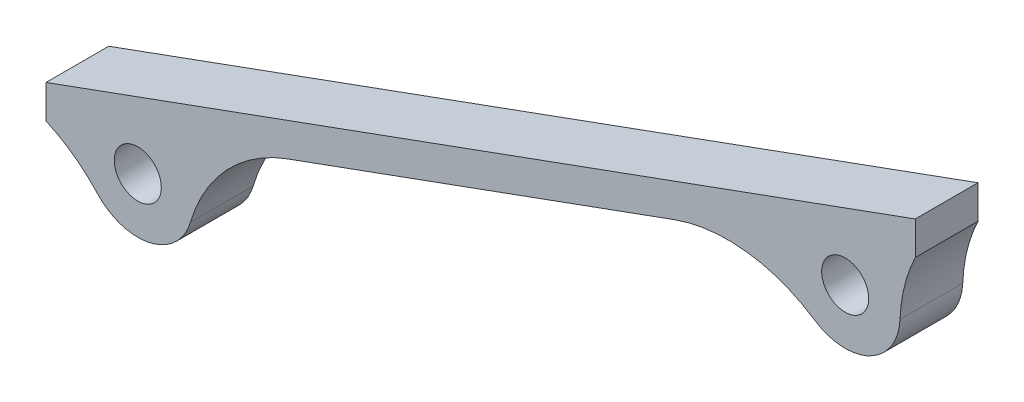
ISO-10303-21;
HEADER;
FILE_DESCRIPTION(('STEP AP214'),'2;1');
FILE_NAME('part.step','',(''),(''),'','','');
FILE_SCHEMA(('AUTOMOTIVE_DESIGN { 1 0 10303 214 1 1 1 1 }'));
ENDSEC;
DATA;
#1=APPLICATION_CONTEXT('core data for automotive mechanical design processes');
#2=APPLICATION_PROTOCOL_DEFINITION('international standard','automotive_design',2000,#1);
#3=PRODUCT_CONTEXT('',#1,'mechanical');
#4=PRODUCT('Part','Part','',(#3));
#5=PRODUCT_RELATED_PRODUCT_CATEGORY('part','',(#4));
#6=PRODUCT_DEFINITION_FORMATION('','',#4);
#7=PRODUCT_DEFINITION_CONTEXT('part definition',#1,'design');
#8=PRODUCT_DEFINITION('design','',#6,#7);
#9=PRODUCT_DEFINITION_SHAPE('','',#8);
#10=(LENGTH_UNIT() NAMED_UNIT(*) SI_UNIT(.MILLI.,.METRE.));
#11=(NAMED_UNIT(*) PLANE_ANGLE_UNIT() SI_UNIT($,.RADIAN.));
#12=(NAMED_UNIT(*) SI_UNIT($,.STERADIAN.) SOLID_ANGLE_UNIT());
#13=UNCERTAINTY_MEASURE_WITH_UNIT(LENGTH_MEASURE(1.E-05),#10,'distance_accuracy_value','');
#14=(GEOMETRIC_REPRESENTATION_CONTEXT(3) GLOBAL_UNCERTAINTY_ASSIGNED_CONTEXT((#13)) GLOBAL_UNIT_ASSIGNED_CONTEXT((#10,
#11,#12)) REPRESENTATION_CONTEXT('',''));
#15=CARTESIAN_POINT('',(0.,0.,0.));
#16=DIRECTION('',(0.,0.,1.));
#17=DIRECTION('',(1.,0.,0.));
#18=AXIS2_PLACEMENT_3D('',#15,#16,#17);
#19=CARTESIAN_POINT('',(-70.,-67.4869031986386,4.));
#20=DIRECTION('',(-0.342020143325671,0.939692620785908,0.));
#21=DIRECTION('',(-0.939692620785908,-0.342020143325671,0.));
#22=AXIS2_PLACEMENT_3D('',#19,#20,#21);
#23=PLANE('',#22);
#24=DIRECTION('',(0.939692620785908,0.342020143325671,0.));
#25=VECTOR('',#24,1.);
#26=CARTESIAN_POINT('',(-70.,-67.4869031986386,4.));
#27=LINE('',#26,#25);
#28=CARTESIAN_POINT('',(-54.6132084234672,-61.8865690639227,4.));
#29=VERTEX_POINT('',#28);
#30=CARTESIAN_POINT('',(-29.9449269501642,-52.9080488771399,4.));
#31=VERTEX_POINT('',#30);
#32=EDGE_CURVE('E125',#29,#31,#27,.T.);
#33=ORIENTED_EDGE('',*,*,#32,.F.);
#34=DIRECTION('',(0.,0.,-1.));
#35=VECTOR('',#34,1.);
#36=CARTESIAN_POINT('',(-54.6132084234672,-61.8865690639227,4.));
#37=LINE('',#36,#35);
#38=CARTESIAN_POINT('',(-54.6132084234672,-61.8865690639227,0.));
#39=VERTEX_POINT('',#38);
#40=EDGE_CURVE('E166',#29,#39,#37,.T.);
#41=ORIENTED_EDGE('',*,*,#40,.T.);
#42=DIRECTION('',(0.939692620785908,0.342020143325671,0.));
#43=VECTOR('',#42,1.);
#44=CARTESIAN_POINT('',(-70.,-67.4869031986386,0.));
#45=LINE('',#44,#43);
#46=CARTESIAN_POINT('',(-29.9449269501642,-52.9080488771399,0.));
#47=VERTEX_POINT('',#46);
#48=EDGE_CURVE('E158',#39,#47,#45,.T.);
#49=ORIENTED_EDGE('',*,*,#48,.T.);
#50=DIRECTION('',(0.,0.,-1.));
#51=VECTOR('',#50,1.);
#52=CARTESIAN_POINT('',(-29.9449269501642,-52.9080488771399,4.));
#53=LINE('',#52,#51);
#54=EDGE_CURVE('E163',#47,#31,#53,.F.);
#55=ORIENTED_EDGE('',*,*,#54,.T.);
#56=EDGE_LOOP('',(#33,#41,#49,#55));
#57=FACE_BOUND('',#56,.T.);
#58=ADVANCED_FACE('F37',(#57),#23,.F.);
#59=CARTESIAN_POINT('',(-70.,-65.3585476536867,4.));
#60=DIRECTION('',(1.,0.,0.));
#61=DIRECTION('',(0.,0.,-1.));
#62=AXIS2_PLACEMENT_3D('',#59,#60,#61);
#63=PLANE('',#62);
#64=DIRECTION('',(0.,-1.,0.));
#65=VECTOR('',#64,1.);
#66=CARTESIAN_POINT('',(-70.,-65.3585476536867,0.));
#67=LINE('',#66,#65);
#68=CARTESIAN_POINT('',(-70.,-65.3585476536867,0.));
#69=VERTEX_POINT('',#68);
#70=CARTESIAN_POINT('',(-70.,-67.4869031986386,0.));
#71=VERTEX_POINT('',#70);
#72=EDGE_CURVE('E133',#69,#71,#67,.T.);
#73=ORIENTED_EDGE('',*,*,#72,.T.);
#74=DIRECTION('',(0.,0.,-1.));
#75=VECTOR('',#74,1.);
#76=CARTESIAN_POINT('',(-70.,-67.4869031986386,4.));
#77=LINE('',#76,#75);
#78=CARTESIAN_POINT('',(-70.,-67.4869031986386,4.));
#79=VERTEX_POINT('',#78);
#80=EDGE_CURVE('E130',#79,#71,#77,.T.);
#81=ORIENTED_EDGE('',*,*,#80,.F.);
#82=DIRECTION('',(0.,-1.,0.));
#83=VECTOR('',#82,1.);
#84=CARTESIAN_POINT('',(-70.,-65.3585476536867,4.));
#85=LINE('',#84,#83);
#86=CARTESIAN_POINT('',(-70.,-65.3585476536867,4.));
#87=VERTEX_POINT('',#86);
#88=EDGE_CURVE('E114',#87,#79,#85,.T.);
#89=ORIENTED_EDGE('',*,*,#88,.F.);
#90=DIRECTION('',(0.,0.,-1.));
#91=VECTOR('',#90,1.);
#92=CARTESIAN_POINT('',(-70.,-65.3585476536867,4.));
#93=LINE('',#92,#91);
#94=EDGE_CURVE('E195',#87,#69,#93,.T.);
#95=ORIENTED_EDGE('',*,*,#94,.T.);
#96=EDGE_LOOP('',(#73,#81,#89,#95));
#97=FACE_BOUND('',#96,.T.);
#98=ADVANCED_FACE('F131',(#97),#63,.F.);
#99=CARTESIAN_POINT('',(-14.5723358707317,-47.3128833006803,4.));
#100=DIRECTION('',(-1.,0.,0.));
#101=DIRECTION('',(0.,0.,1.));
#102=AXIS2_PLACEMENT_3D('',#99,#100,#101);
#103=PLANE('',#102);
#104=DIRECTION('',(0.,1.,0.));
#105=VECTOR('',#104,1.);
#106=CARTESIAN_POINT('',(-14.5723358707317,-47.3128833006803,0.));
#107=LINE('',#106,#105);
#108=CARTESIAN_POINT('',(-14.5723358707317,-47.3128833006803,0.));
#109=VERTEX_POINT('',#108);
#110=CARTESIAN_POINT('',(-14.5723358707317,-45.1845277557284,0.));
#111=VERTEX_POINT('',#110);
#112=EDGE_CURVE('E167',#109,#111,#107,.T.);
#113=ORIENTED_EDGE('',*,*,#112,.T.);
#114=DIRECTION('',(0.,0.,-1.));
#115=VECTOR('',#114,1.);
#116=CARTESIAN_POINT('',(-14.5723358707317,-45.1845277557284,4.));
#117=LINE('',#116,#115);
#118=CARTESIAN_POINT('',(-14.5723358707317,-45.1845277557284,4.));
#119=VERTEX_POINT('',#118);
#120=EDGE_CURVE('E193',#119,#111,#117,.T.);
#121=ORIENTED_EDGE('',*,*,#120,.F.);
#122=DIRECTION('',(0.,1.,0.));
#123=VECTOR('',#122,1.);
#124=CARTESIAN_POINT('',(-14.5723358707317,-47.3128833006803,4.));
#125=LINE('',#124,#123);
#126=CARTESIAN_POINT('',(-14.5723358707317,-47.3128833006803,4.));
#127=VERTEX_POINT('',#126);
#128=EDGE_CURVE('E223',#127,#119,#125,.T.);
#129=ORIENTED_EDGE('',*,*,#128,.F.);
#130=DIRECTION('',(0.,0.,-1.));
#131=VECTOR('',#130,1.);
#132=CARTESIAN_POINT('',(-14.5723358707317,-47.3128833006803,4.));
#133=LINE('',#132,#131);
#134=EDGE_CURVE('E136',#127,#109,#133,.T.);
#135=ORIENTED_EDGE('',*,*,#134,.T.);
#136=EDGE_LOOP('',(#113,#121,#129,#135));
#137=FACE_BOUND('',#136,.T.);
#138=ADVANCED_FACE('F233',(#137),#103,.F.);
#139=CARTESIAN_POINT('',(-70.,-65.3585476536867,4.));
#140=DIRECTION('',(-0.342020143325671,0.939692620785908,0.));
#141=DIRECTION('',(-0.939692620785908,-0.342020143325671,0.));
#142=AXIS2_PLACEMENT_3D('',#139,#140,#141);
#143=PLANE('',#142);
#144=DIRECTION('',(0.939692620785908,0.342020143325671,0.));
#145=VECTOR('',#144,1.);
#146=CARTESIAN_POINT('',(-70.,-65.3585476536867,0.));
#147=LINE('',#146,#145);
#148=EDGE_CURVE('E126',#69,#111,#147,.T.);
#149=ORIENTED_EDGE('',*,*,#148,.F.);
#150=ORIENTED_EDGE('',*,*,#94,.F.);
#151=DIRECTION('',(0.939692620785908,0.342020143325671,0.));
#152=VECTOR('',#151,1.);
#153=CARTESIAN_POINT('',(-70.,-65.3585476536867,4.));
#154=LINE('',#153,#152);
#155=EDGE_CURVE('E123',#87,#119,#154,.T.);
#156=ORIENTED_EDGE('',*,*,#155,.T.);
#157=ORIENTED_EDGE('',*,*,#120,.T.);
#158=EDGE_LOOP('',(#149,#150,#156,#157));
#159=FACE_BOUND('',#158,.T.);
#160=ADVANCED_FACE('F231',(#159),#143,.T.);
#161=CARTESIAN_POINT('',(0.,0.,4.));
#162=DIRECTION('',(0.,0.,1.));
#163=DIRECTION('',(1.,0.,0.));
#164=AXIS2_PLACEMENT_3D('',#161,#162,#163);
#165=PLANE('',#164);
#166=ORIENTED_EDGE('',*,*,#88,.T.);
#167=CARTESIAN_POINT('',(-74.098227445234,-76.6085550121606,4.));
#168=DIRECTION('',(0.,0.,1.));
#169=DIRECTION('',(1.,0.,0.));
#170=AXIS2_PLACEMENT_3D('',#167,#168,#169);
#171=CIRCLE('',#170,10.);
#172=CARTESIAN_POINT('',(-66.7274295591541,-69.8504977082781,4.));
#173=VERTEX_POINT('',#172);
#174=EDGE_CURVE('E120',#79,#173,#171,.F.);
#175=ORIENTED_EDGE('',*,*,#174,.T.);
#176=CARTESIAN_POINT('',(-64.1476502990262,-67.4851776519192,4.));
#177=DIRECTION('',(0.,0.,1.));
#178=DIRECTION('',(1.,0.,0.));
#179=AXIS2_PLACEMENT_3D('',#176,#177,#178);
#180=CIRCLE('',#179,3.50000000000001);
#181=CARTESIAN_POINT('',(-60.7890390708147,-68.4699266644761,4.));
#182=VERTEX_POINT('',#181);
#183=EDGE_CURVE('E202',#182,#173,#180,.F.);
#184=ORIENTED_EDGE('',*,*,#183,.F.);
#185=CARTESIAN_POINT('',(-51.1930069902105,-71.2834952717817,4.));
#186=DIRECTION('',(0.,0.,1.));
#187=DIRECTION('',(1.,0.,0.));
#188=AXIS2_PLACEMENT_3D('',#185,#186,#187);
#189=CIRCLE('',#188,10.);
#190=EDGE_CURVE('E145',#182,#29,#189,.F.);
#191=ORIENTED_EDGE('',*,*,#190,.T.);
#192=ORIENTED_EDGE('',*,*,#32,.T.);
#193=CARTESIAN_POINT('',(-26.5247255169075,-62.304975084999,4.));
#194=DIRECTION('',(0.,0.,1.));
#195=DIRECTION('',(1.,0.,0.));
#196=AXIS2_PLACEMENT_3D('',#193,#194,#195);
#197=CIRCLE('',#196,10.);
#198=CARTESIAN_POINT('',(-20.9822655053483,-53.9814459644716,4.));
#199=VERTEX_POINT('',#198);
#200=EDGE_CURVE('E12',#31,#199,#197,.F.);
#201=ORIENTED_EDGE('',*,*,#200,.T.);
#202=CARTESIAN_POINT('',(-19.0424045013026,-51.068210772287,4.));
#203=DIRECTION('',(0.,0.,1.));
#204=DIRECTION('',(1.,0.,0.));
#205=AXIS2_PLACEMENT_3D('',#202,#203,#204);
#206=CIRCLE('',#205,3.50000000000001);
#207=CARTESIAN_POINT('',(-15.545482944416,-51.2149746131396,4.));
#208=VERTEX_POINT('',#207);
#209=EDGE_CURVE('E181',#208,#199,#206,.F.);
#210=ORIENTED_EDGE('',*,*,#209,.F.);
#211=CARTESIAN_POINT('',(-5.55427849616855,-51.6342998727186,4.));
#212=DIRECTION('',(0.,0.,1.));
#213=DIRECTION('',(1.,0.,0.));
#214=AXIS2_PLACEMENT_3D('',#211,#212,#213);
#215=CIRCLE('',#214,10.);
#216=EDGE_CURVE('E153',#208,#127,#215,.F.);
#217=ORIENTED_EDGE('',*,*,#216,.T.);
#218=ORIENTED_EDGE('',*,*,#128,.T.);
#219=ORIENTED_EDGE('',*,*,#155,.F.);
#220=EDGE_LOOP('',(#166,#175,#184,#191,#192,#201,#210,#217,#218,#219));
#221=FACE_BOUND('',#220,.T.);
#222=CARTESIAN_POINT('',(-19.0424045013026,-51.068210772287,4.));
#223=DIRECTION('',(0.,0.,1.));
#224=DIRECTION('',(1.,0.,0.));
#225=AXIS2_PLACEMENT_3D('',#222,#223,#224);
#226=CIRCLE('',#225,1.5);
#227=CARTESIAN_POINT('',(-17.5424045013026,-51.068210772287,4.));
#228=VERTEX_POINT('',#227);
#229=EDGE_CURVE('E216',#228,#228,#226,.F.);
#230=ORIENTED_EDGE('',*,*,#229,.T.);
#231=EDGE_LOOP('',(#230));
#232=FACE_BOUND('',#231,.T.);
#233=CARTESIAN_POINT('',(-64.1476502990262,-67.4851776519192,4.));
#234=DIRECTION('',(0.,0.,1.));
#235=DIRECTION('',(1.,0.,0.));
#236=AXIS2_PLACEMENT_3D('',#233,#234,#235);
#237=CIRCLE('',#236,1.5);
#238=CARTESIAN_POINT('',(-62.6476502990262,-67.4851776519192,4.));
#239=VERTEX_POINT('',#238);
#240=EDGE_CURVE('E186',#239,#239,#237,.F.);
#241=ORIENTED_EDGE('',*,*,#240,.T.);
#242=EDGE_LOOP('',(#241));
#243=FACE_BOUND('',#242,.T.);
#244=ADVANCED_FACE('F116',(#221,#232,#243),#165,.T.);
#245=CARTESIAN_POINT('',(0.,0.,0.));
#246=DIRECTION('',(0.,0.,1.));
#247=DIRECTION('',(1.,0.,0.));
#248=AXIS2_PLACEMENT_3D('',#245,#246,#247);
#249=PLANE('',#248);
#250=ORIENTED_EDGE('',*,*,#72,.F.);
#251=ORIENTED_EDGE('',*,*,#148,.T.);
#252=ORIENTED_EDGE('',*,*,#112,.F.);
#253=CARTESIAN_POINT('',(-5.55427849616855,-51.6342998727186,0.));
#254=DIRECTION('',(0.,0.,1.));
#255=DIRECTION('',(1.,0.,0.));
#256=AXIS2_PLACEMENT_3D('',#253,#254,#255);
#257=CIRCLE('',#256,10.);
#258=CARTESIAN_POINT('',(-15.545482944416,-51.2149746131396,0.));
#259=VERTEX_POINT('',#258);
#260=EDGE_CURVE('E59',#109,#259,#257,.T.);
#261=ORIENTED_EDGE('',*,*,#260,.T.);
#262=CARTESIAN_POINT('',(-19.0424045013026,-51.068210772287,0.));
#263=DIRECTION('',(0.,0.,-1.));
#264=DIRECTION('',(-1.,0.,0.));
#265=AXIS2_PLACEMENT_3D('',#262,#263,#264);
#266=CIRCLE('',#265,3.50000000000001);
#267=CARTESIAN_POINT('',(-20.9822655053483,-53.9814459644716,0.));
#268=VERTEX_POINT('',#267);
#269=EDGE_CURVE('E159',#259,#268,#266,.T.);
#270=ORIENTED_EDGE('',*,*,#269,.T.);
#271=CARTESIAN_POINT('',(-26.5247255169075,-62.304975084999,0.));
#272=DIRECTION('',(0.,0.,1.));
#273=DIRECTION('',(1.,0.,0.));
#274=AXIS2_PLACEMENT_3D('',#271,#272,#273);
#275=CIRCLE('',#274,10.);
#276=EDGE_CURVE('E45',#268,#47,#275,.T.);
#277=ORIENTED_EDGE('',*,*,#276,.T.);
#278=ORIENTED_EDGE('',*,*,#48,.F.);
#279=CARTESIAN_POINT('',(-51.1930069902105,-71.2834952717817,0.));
#280=DIRECTION('',(0.,0.,1.));
#281=DIRECTION('',(1.,0.,0.));
#282=AXIS2_PLACEMENT_3D('',#279,#280,#281);
#283=CIRCLE('',#282,10.);
#284=CARTESIAN_POINT('',(-60.7890390708147,-68.4699266644761,0.));
#285=VERTEX_POINT('',#284);
#286=EDGE_CURVE('E142',#39,#285,#283,.T.);
#287=ORIENTED_EDGE('',*,*,#286,.T.);
#288=CARTESIAN_POINT('',(-64.1476502990262,-67.4851776519192,0.));
#289=DIRECTION('',(0.,0.,-1.));
#290=DIRECTION('',(-1.,0.,0.));
#291=AXIS2_PLACEMENT_3D('',#288,#289,#290);
#292=CIRCLE('',#291,3.50000000000001);
#293=CARTESIAN_POINT('',(-66.7274295591541,-69.8504977082781,0.));
#294=VERTEX_POINT('',#293);
#295=EDGE_CURVE('E204',#285,#294,#292,.T.);
#296=ORIENTED_EDGE('',*,*,#295,.T.);
#297=CARTESIAN_POINT('',(-74.098227445234,-76.6085550121606,0.));
#298=DIRECTION('',(0.,0.,1.));
#299=DIRECTION('',(1.,0.,0.));
#300=AXIS2_PLACEMENT_3D('',#297,#298,#299);
#301=CIRCLE('',#300,10.);
#302=EDGE_CURVE('E143',#294,#71,#301,.T.);
#303=ORIENTED_EDGE('',*,*,#302,.T.);
#304=EDGE_LOOP('',(#250,#251,#252,#261,#270,#277,#278,#287,#296,#303));
#305=FACE_BOUND('',#304,.T.);
#306=CARTESIAN_POINT('',(-19.0424045013026,-51.068210772287,0.));
#307=DIRECTION('',(0.,0.,-1.));
#308=DIRECTION('',(-1.,0.,0.));
#309=AXIS2_PLACEMENT_3D('',#306,#307,#308);
#310=CIRCLE('',#309,1.5);
#311=CARTESIAN_POINT('',(-20.5424045013026,-51.068210772287,0.));
#312=VERTEX_POINT('',#311);
#313=EDGE_CURVE('E185',#312,#312,#310,.T.);
#314=ORIENTED_EDGE('',*,*,#313,.F.);
#315=EDGE_LOOP('',(#314));
#316=FACE_BOUND('',#315,.T.);
#317=CARTESIAN_POINT('',(-64.1476502990262,-67.4851776519192,0.));
#318=DIRECTION('',(0.,0.,-1.));
#319=DIRECTION('',(-1.,0.,0.));
#320=AXIS2_PLACEMENT_3D('',#317,#318,#319);
#321=CIRCLE('',#320,1.5);
#322=CARTESIAN_POINT('',(-65.6476502990262,-67.4851776519192,0.));
#323=VERTEX_POINT('',#322);
#324=EDGE_CURVE('E207',#323,#323,#321,.T.);
#325=ORIENTED_EDGE('',*,*,#324,.F.);
#326=EDGE_LOOP('',(#325));
#327=FACE_BOUND('',#326,.T.);
#328=ADVANCED_FACE('F156',(#305,#316,#327),#249,.F.);
#329=CARTESIAN_POINT('',(-19.0424045013026,-51.068210772287,13.9546455463722));
#330=DIRECTION('',(0.,0.,-1.));
#331=DIRECTION('',(-1.,0.,0.));
#332=AXIS2_PLACEMENT_3D('',#329,#330,#331);
#333=CYLINDRICAL_SURFACE('',#332,1.5);
#334=ORIENTED_EDGE('',*,*,#313,.T.);
#335=EDGE_LOOP('',(#334));
#336=FACE_BOUND('',#335,.T.);
#337=ORIENTED_EDGE('',*,*,#229,.F.);
#338=EDGE_LOOP('',(#337));
#339=FACE_BOUND('',#338,.T.);
#340=ADVANCED_FACE('F292',(#336,#339),#333,.F.);
#341=CARTESIAN_POINT('',(-19.0424045013026,-51.068210772287,13.9546455463722));
#342=DIRECTION('',(0.,0.,-1.));
#343=DIRECTION('',(-1.,0.,0.));
#344=AXIS2_PLACEMENT_3D('',#341,#342,#343);
#345=CYLINDRICAL_SURFACE('',#344,3.50000000000001);
#346=ORIENTED_EDGE('',*,*,#269,.F.);
#347=DIRECTION('',(0.,0.,-1.));
#348=VECTOR('',#347,1.);
#349=CARTESIAN_POINT('',(-15.545482944416,-51.2149746131396,13.9546455463722));
#350=LINE('',#349,#348);
#351=EDGE_CURVE('E147',#259,#208,#350,.F.);
#352=ORIENTED_EDGE('',*,*,#351,.T.);
#353=ORIENTED_EDGE('',*,*,#209,.T.);
#354=DIRECTION('',(0.,0.,-1.));
#355=VECTOR('',#354,1.);
#356=CARTESIAN_POINT('',(-20.9822655053483,-53.9814459644716,13.9546455463722));
#357=LINE('',#356,#355);
#358=EDGE_CURVE('E171',#199,#268,#357,.T.);
#359=ORIENTED_EDGE('',*,*,#358,.T.);
#360=EDGE_LOOP('',(#346,#352,#353,#359));
#361=FACE_BOUND('',#360,.T.);
#362=ADVANCED_FACE('F180',(#361),#345,.T.);
#363=CARTESIAN_POINT('',(-64.1476502990262,-67.4851776519192,13.9546455463722));
#364=DIRECTION('',(0.,0.,-1.));
#365=DIRECTION('',(-1.,0.,0.));
#366=AXIS2_PLACEMENT_3D('',#363,#364,#365);
#367=CYLINDRICAL_SURFACE('',#366,1.5);
#368=ORIENTED_EDGE('',*,*,#324,.T.);
#369=EDGE_LOOP('',(#368));
#370=FACE_BOUND('',#369,.T.);
#371=ORIENTED_EDGE('',*,*,#240,.F.);
#372=EDGE_LOOP('',(#371));
#373=FACE_BOUND('',#372,.T.);
#374=ADVANCED_FACE('F281',(#370,#373),#367,.F.);
#375=CARTESIAN_POINT('',(-64.1476502990262,-67.4851776519192,13.9546455463722));
#376=DIRECTION('',(0.,0.,-1.));
#377=DIRECTION('',(-1.,0.,0.));
#378=AXIS2_PLACEMENT_3D('',#375,#376,#377);
#379=CYLINDRICAL_SURFACE('',#378,3.50000000000001);
#380=ORIENTED_EDGE('',*,*,#183,.T.);
#381=DIRECTION('',(0.,0.,-1.));
#382=VECTOR('',#381,1.);
#383=CARTESIAN_POINT('',(-66.7274295591541,-69.8504977082781,13.9546455463722));
#384=LINE('',#383,#382);
#385=EDGE_CURVE('E141',#173,#294,#384,.T.);
#386=ORIENTED_EDGE('',*,*,#385,.T.);
#387=ORIENTED_EDGE('',*,*,#295,.F.);
#388=DIRECTION('',(0.,0.,-1.));
#389=VECTOR('',#388,1.);
#390=CARTESIAN_POINT('',(-60.7890390708147,-68.4699266644761,13.9546455463722));
#391=LINE('',#390,#389);
#392=EDGE_CURVE('E135',#285,#182,#391,.F.);
#393=ORIENTED_EDGE('',*,*,#392,.T.);
#394=EDGE_LOOP('',(#380,#386,#387,#393));
#395=FACE_BOUND('',#394,.T.);
#396=ADVANCED_FACE('F201',(#395),#379,.T.);
#397=CARTESIAN_POINT('',(-74.098227445234,-76.6085550121606,4.));
#398=DIRECTION('',(0.,0.,1.));
#399=DIRECTION('',(1.,0.,0.));
#400=AXIS2_PLACEMENT_3D('',#397,#398,#399);
#401=CYLINDRICAL_SURFACE('',#400,10.);
#402=ORIENTED_EDGE('',*,*,#174,.F.);
#403=ORIENTED_EDGE('',*,*,#80,.T.);
#404=ORIENTED_EDGE('',*,*,#302,.F.);
#405=ORIENTED_EDGE('',*,*,#385,.F.);
#406=EDGE_LOOP('',(#402,#403,#404,#405));
#407=FACE_BOUND('',#406,.T.);
#408=ADVANCED_FACE('F139',(#407),#401,.F.);
#409=CARTESIAN_POINT('',(-51.1930069902105,-71.2834952717817,13.9546455463722));
#410=DIRECTION('',(0.,0.,-1.));
#411=DIRECTION('',(-1.,0.,0.));
#412=AXIS2_PLACEMENT_3D('',#409,#410,#411);
#413=CYLINDRICAL_SURFACE('',#412,10.);
#414=ORIENTED_EDGE('',*,*,#190,.F.);
#415=ORIENTED_EDGE('',*,*,#392,.F.);
#416=ORIENTED_EDGE('',*,*,#286,.F.);
#417=ORIENTED_EDGE('',*,*,#40,.F.);
#418=EDGE_LOOP('',(#414,#415,#416,#417));
#419=FACE_BOUND('',#418,.T.);
#420=ADVANCED_FACE('F209',(#419),#413,.F.);
#421=CARTESIAN_POINT('',(-5.55427849616855,-51.6342998727186,13.9546455463722));
#422=DIRECTION('',(0.,0.,1.));
#423=DIRECTION('',(1.,0.,0.));
#424=AXIS2_PLACEMENT_3D('',#421,#422,#423);
#425=CYLINDRICAL_SURFACE('',#424,10.);
#426=ORIENTED_EDGE('',*,*,#216,.F.);
#427=ORIENTED_EDGE('',*,*,#351,.F.);
#428=ORIENTED_EDGE('',*,*,#260,.F.);
#429=ORIENTED_EDGE('',*,*,#134,.F.);
#430=EDGE_LOOP('',(#426,#427,#428,#429));
#431=FACE_BOUND('',#430,.T.);
#432=ADVANCED_FACE('F189',(#431),#425,.F.);
#433=CARTESIAN_POINT('',(-26.5247255169075,-62.304975084999,13.9546455463722));
#434=DIRECTION('',(0.,0.,-1.));
#435=DIRECTION('',(-1.,0.,0.));
#436=AXIS2_PLACEMENT_3D('',#433,#434,#435);
#437=CYLINDRICAL_SURFACE('',#436,10.);
#438=ORIENTED_EDGE('',*,*,#200,.F.);
#439=ORIENTED_EDGE('',*,*,#54,.F.);
#440=ORIENTED_EDGE('',*,*,#276,.F.);
#441=ORIENTED_EDGE('',*,*,#358,.F.);
#442=EDGE_LOOP('',(#438,#439,#440,#441));
#443=FACE_BOUND('',#442,.T.);
#444=ADVANCED_FACE('F39',(#443),#437,.F.);
#445=CLOSED_SHELL('',(#58,#98,#138,#160,#244,#328,#340,#362,#374,#396,#408,#420,#432,#444));
#446=MANIFOLD_SOLID_BREP('B2',#445);
#447=ADVANCED_BREP_SHAPE_REPRESENTATION('',(#18,#446),#14);
#448=SHAPE_DEFINITION_REPRESENTATION(#9,#447);
ENDSEC;
END-ISO-10303-21;
